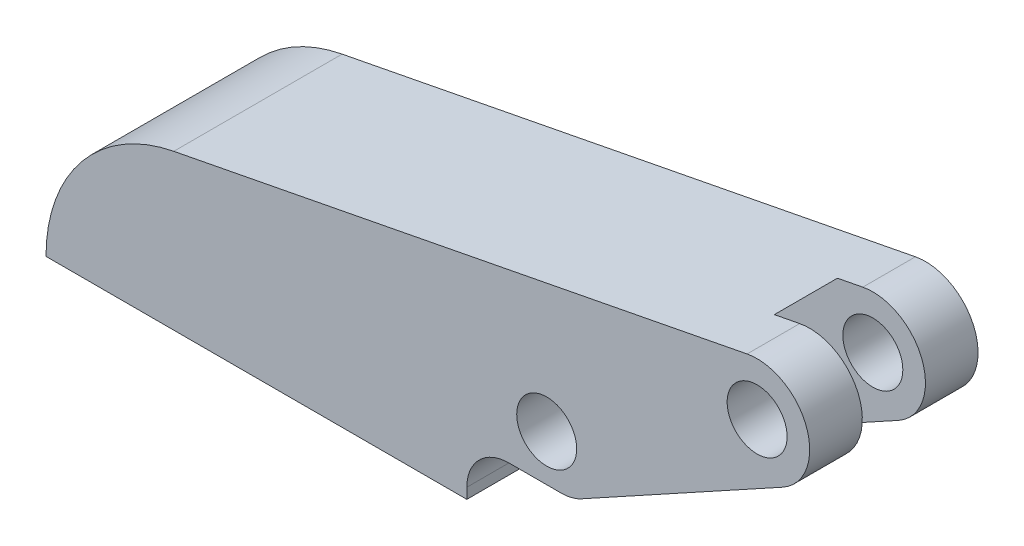
ISO-10303-21;
HEADER;
FILE_DESCRIPTION(('STEP AP214'),'2;1');
FILE_NAME('part.step','',(''),(''),'','','');
FILE_SCHEMA(('AUTOMOTIVE_DESIGN { 1 0 10303 214 1 1 1 1 }'));
ENDSEC;
DATA;
#1=APPLICATION_CONTEXT('core data for automotive mechanical design processes');
#2=APPLICATION_PROTOCOL_DEFINITION('international standard','automotive_design',2000,#1);
#3=PRODUCT_CONTEXT('',#1,'mechanical');
#4=PRODUCT('Part','Part','',(#3));
#5=PRODUCT_RELATED_PRODUCT_CATEGORY('part','',(#4));
#6=PRODUCT_DEFINITION_FORMATION('','',#4);
#7=PRODUCT_DEFINITION_CONTEXT('part definition',#1,'design');
#8=PRODUCT_DEFINITION('design','',#6,#7);
#9=PRODUCT_DEFINITION_SHAPE('','',#8);
#10=(LENGTH_UNIT() NAMED_UNIT(*) SI_UNIT(.MILLI.,.METRE.));
#11=(NAMED_UNIT(*) PLANE_ANGLE_UNIT() SI_UNIT($,.RADIAN.));
#12=(NAMED_UNIT(*) SI_UNIT($,.STERADIAN.) SOLID_ANGLE_UNIT());
#13=UNCERTAINTY_MEASURE_WITH_UNIT(LENGTH_MEASURE(1.E-05),#10,'distance_accuracy_value','');
#14=(GEOMETRIC_REPRESENTATION_CONTEXT(3) GLOBAL_UNCERTAINTY_ASSIGNED_CONTEXT((#13)) GLOBAL_UNIT_ASSIGNED_CONTEXT((#10,
#11,#12)) REPRESENTATION_CONTEXT('',''));
#15=CARTESIAN_POINT('',(0.,0.,0.));
#16=DIRECTION('',(0.,0.,1.));
#17=DIRECTION('',(1.,0.,0.));
#18=AXIS2_PLACEMENT_3D('',#15,#16,#17);
#19=CARTESIAN_POINT('',(45.8343180392922,14.7059179973023,16.));
#20=DIRECTION('',(-0.481918749772156,0.876215908676647,0.));
#21=DIRECTION('',(-0.876215908676647,-0.481918749772156,0.));
#22=AXIS2_PLACEMENT_3D('',#19,#20,#21);
#23=PLANE('',#22);
#24=DIRECTION('',(0.876215908676647,0.481918749772156,0.));
#25=VECTOR('',#24,1.);
#26=CARTESIAN_POINT('',(45.8343180392922,14.7059179973023,4.99999999999999));
#27=LINE('',#26,#25);
#28=CARTESIAN_POINT('',(42.5904062511392,12.9217665138182,5.));
#29=VERTEX_POINT('',#28);
#30=CARTESIAN_POINT('',(64.227719619958,24.8222888666685,4.99999999999999));
#31=VERTEX_POINT('',#30);
#32=EDGE_CURVE('E173',#29,#31,#27,.T.);
#33=ORIENTED_EDGE('',*,*,#32,.T.);
#34=DIRECTION('',(0.,0.,1.));
#35=VECTOR('',#34,1.);
#36=CARTESIAN_POINT('',(64.227719619958,24.8222888666685,16.));
#37=LINE('',#36,#35);
#38=CARTESIAN_POINT('',(64.2277196199582,24.8222888666686,11.));
#39=VERTEX_POINT('',#38);
#40=EDGE_CURVE('E14',#31,#39,#37,.T.);
#41=ORIENTED_EDGE('',*,*,#40,.T.);
#42=DIRECTION('',(0.876215908676647,0.481918749772156,0.));
#43=VECTOR('',#42,1.);
#44=CARTESIAN_POINT('',(86.6879313200957,37.1754053017442,11.));
#45=LINE('',#44,#43);
#46=CARTESIAN_POINT('',(42.5904062511392,12.9217665138182,11.));
#47=VERTEX_POINT('',#46);
#48=EDGE_CURVE('E391',#47,#39,#45,.T.);
#49=ORIENTED_EDGE('',*,*,#48,.F.);
#50=DIRECTION('',(0.,0.,1.));
#51=VECTOR('',#50,1.);
#52=CARTESIAN_POINT('',(42.5904062511392,12.9217665138182,11.));
#53=LINE('',#52,#51);
#54=EDGE_CURVE('E207',#29,#47,#53,.T.);
#55=ORIENTED_EDGE('',*,*,#54,.F.);
#56=EDGE_LOOP('',(#33,#41,#49,#55));
#57=FACE_BOUND('',#56,.T.);
#58=ADVANCED_FACE('F51',(#57),#23,.F.);
#59=CARTESIAN_POINT('',(72.5904062511392,62.8072690634833,11.));
#60=DIRECTION('',(0.,0.,-1.));
#61=DIRECTION('',(-1.,0.,0.));
#62=AXIS2_PLACEMENT_3D('',#59,#60,#61);
#63=PLANE('',#62);
#64=CARTESIAN_POINT('',(47.5904062511392,9.38107954338324,11.));
#65=DIRECTION('',(0.,0.,-1.));
#66=DIRECTION('',(-1.,0.,0.));
#67=AXIS2_PLACEMENT_3D('',#64,#65,#66);
#68=CIRCLE('',#67,2.85);
#69=CARTESIAN_POINT('',(44.7404062511392,9.38107954338324,11.));
#70=VERTEX_POINT('',#69);
#71=EDGE_CURVE('E385',#70,#70,#68,.T.);
#72=ORIENTED_EDGE('',*,*,#71,.F.);
#73=EDGE_LOOP('',(#72));
#74=FACE_BOUND('',#73,.T.);
#75=CARTESIAN_POINT('',(67.5904062511392,20.3810795433832,11.));
#76=DIRECTION('',(0.,0.,-1.));
#77=DIRECTION('',(-1.,0.,0.));
#78=AXIS2_PLACEMENT_3D('',#75,#76,#77);
#79=CIRCLE('',#78,2.85);
#80=CARTESIAN_POINT('',(64.7404062511392,20.3810795433832,11.));
#81=VERTEX_POINT('',#80);
#82=EDGE_CURVE('E206',#81,#81,#79,.T.);
#83=ORIENTED_EDGE('',*,*,#82,.F.);
#84=EDGE_LOOP('',(#83));
#85=FACE_BOUND('',#84,.T.);
#86=DIRECTION('',(-0.981723650130097,-0.190312045796475,0.));
#87=VECTOR('',#86,1.);
#88=CARTESIAN_POINT('',(12.1453193130529,14.7258547519514,11.));
#89=LINE('',#88,#87);
#90=CARTESIAN_POINT('',(66.6388460221569,25.2896977940337,11.));
#91=VERTEX_POINT('',#90);
#92=EDGE_CURVE('E58',#91,#39,#89,.T.);
#93=ORIENTED_EDGE('',*,*,#92,.F.);
#94=CARTESIAN_POINT('',(67.5904062511392,20.3810795433832,11.));
#95=DIRECTION('',(0.,0.,-1.));
#96=DIRECTION('',(-1.,0.,0.));
#97=AXIS2_PLACEMENT_3D('',#94,#95,#96);
#98=CIRCLE('',#97,5.);
#99=CARTESIAN_POINT('',(70.,16.,11.));
#100=VERTEX_POINT('',#99);
#101=EDGE_CURVE('E384',#100,#91,#98,.F.);
#102=ORIENTED_EDGE('',*,*,#101,.F.);
#103=DIRECTION('',(-0.876215908676647,-0.481918749772156,0.));
#104=VECTOR('',#103,1.);
#105=CARTESIAN_POINT('',(50.9002479368971,5.49513636529341,11.));
#106=LINE('',#105,#104);
#107=CARTESIAN_POINT('',(50.9002479368971,5.49513636529341,11.));
#108=VERTEX_POINT('',#107);
#109=EDGE_CURVE('E381',#100,#108,#106,.T.);
#110=ORIENTED_EDGE('',*,*,#109,.T.);
#111=CARTESIAN_POINT('',(48.9725729378085,9.,11.));
#112=DIRECTION('',(0.,0.,-1.));
#113=DIRECTION('',(-1.,0.,0.));
#114=AXIS2_PLACEMENT_3D('',#111,#112,#113);
#115=CIRCLE('',#114,4.);
#116=CARTESIAN_POINT('',(48.9725729378085,5.,11.));
#117=VERTEX_POINT('',#116);
#118=EDGE_CURVE('E376',#117,#108,#115,.F.);
#119=ORIENTED_EDGE('',*,*,#118,.F.);
#120=DIRECTION('',(-1.,0.,0.));
#121=VECTOR('',#120,1.);
#122=CARTESIAN_POINT('',(44.,5.,11.));
#123=LINE('',#122,#121);
#124=CARTESIAN_POINT('',(44.,5.,11.));
#125=VERTEX_POINT('',#124);
#126=EDGE_CURVE('E369',#117,#125,#123,.T.);
#127=ORIENTED_EDGE('',*,*,#126,.T.);
#128=CARTESIAN_POINT('',(44.,1.,11.));
#129=DIRECTION('',(0.,0.,-1.));
#130=DIRECTION('',(-1.,0.,0.));
#131=AXIS2_PLACEMENT_3D('',#128,#129,#130);
#132=CIRCLE('',#131,4.);
#133=CARTESIAN_POINT('',(42.5904062511392,4.74340025420374,11.));
#134=VERTEX_POINT('',#133);
#135=EDGE_CURVE('E315',#125,#134,#132,.F.);
#136=ORIENTED_EDGE('',*,*,#135,.T.);
#137=DIRECTION('',(0.,-1.,0.));
#138=VECTOR('',#137,1.);
#139=CARTESIAN_POINT('',(42.5904062511392,62.8072690634833,11.));
#140=LINE('',#139,#138);
#141=EDGE_CURVE('E190',#47,#134,#140,.T.);
#142=ORIENTED_EDGE('',*,*,#141,.F.);
#143=ORIENTED_EDGE('',*,*,#48,.T.);
#144=EDGE_LOOP('',(#93,#102,#110,#119,#127,#136,#142,#143));
#145=FACE_BOUND('',#144,.T.);
#146=ADVANCED_FACE('F457',(#74,#85,#145),#63,.T.);
#147=CARTESIAN_POINT('',(44.,1.,4.99999999999999));
#148=DIRECTION('',(0.,0.,1.));
#149=DIRECTION('',(1.,0.,0.));
#150=AXIS2_PLACEMENT_3D('',#147,#148,#149);
#151=PLANE('',#150);
#152=CARTESIAN_POINT('',(67.5904062511392,20.3810795433832,4.99999999999999));
#153=DIRECTION('',(0.,0.,-1.));
#154=DIRECTION('',(1.,0.,0.));
#155=AXIS2_PLACEMENT_3D('',#152,#153,#154);
#156=CIRCLE('',#155,2.85000000000001);
#157=CARTESIAN_POINT('',(70.4404062511392,20.3810795433832,4.99999999999999));
#158=VERTEX_POINT('',#157);
#159=EDGE_CURVE('E420',#158,#158,#156,.T.);
#160=ORIENTED_EDGE('',*,*,#159,.T.);
#161=EDGE_LOOP('',(#160));
#162=FACE_BOUND('',#161,.T.);
#163=CARTESIAN_POINT('',(47.5904062511392,9.38107954338324,4.99999999999999));
#164=DIRECTION('',(0.,0.,-1.));
#165=DIRECTION('',(1.,0.,0.));
#166=AXIS2_PLACEMENT_3D('',#163,#164,#165);
#167=CIRCLE('',#166,2.85);
#168=CARTESIAN_POINT('',(50.4404062511392,9.38107954338324,4.99999999999999));
#169=VERTEX_POINT('',#168);
#170=EDGE_CURVE('E408',#169,#169,#167,.T.);
#171=ORIENTED_EDGE('',*,*,#170,.T.);
#172=EDGE_LOOP('',(#171));
#173=FACE_BOUND('',#172,.T.);
#174=CARTESIAN_POINT('',(67.5904062511392,20.3810795433832,4.99999999999999));
#175=DIRECTION('',(0.,0.,-1.));
#176=DIRECTION('',(-1.,0.,0.));
#177=AXIS2_PLACEMENT_3D('',#174,#175,#176);
#178=CIRCLE('',#177,5.);
#179=CARTESIAN_POINT('',(66.6388460221569,25.2896977940337,4.99999999999999));
#180=VERTEX_POINT('',#179);
#181=CARTESIAN_POINT('',(70.,16.,4.99999999999999));
#182=VERTEX_POINT('',#181);
#183=EDGE_CURVE('E415',#180,#182,#178,.T.);
#184=ORIENTED_EDGE('',*,*,#183,.F.);
#185=DIRECTION('',(-0.981723650130097,-0.190312045796475,0.));
#186=VECTOR('',#185,1.);
#187=CARTESIAN_POINT('',(40.281811580834,20.1802546783549,4.99999999999999));
#188=LINE('',#187,#186);
#189=EDGE_CURVE('E192',#180,#31,#188,.T.);
#190=ORIENTED_EDGE('',*,*,#189,.T.);
#191=ORIENTED_EDGE('',*,*,#32,.F.);
#192=DIRECTION('',(0.,1.,0.));
#193=VECTOR('',#192,1.);
#194=CARTESIAN_POINT('',(42.5904062511392,4.74340025420374,5.));
#195=LINE('',#194,#193);
#196=CARTESIAN_POINT('',(42.5904062511392,4.74340025420374,5.));
#197=VERTEX_POINT('',#196);
#198=EDGE_CURVE('E166',#197,#29,#195,.T.);
#199=ORIENTED_EDGE('',*,*,#198,.F.);
#200=CARTESIAN_POINT('',(44.,1.,4.99999999999999));
#201=DIRECTION('',(0.,0.,1.));
#202=DIRECTION('',(1.,0.,0.));
#203=AXIS2_PLACEMENT_3D('',#200,#201,#202);
#204=CIRCLE('',#203,3.99999999999999);
#205=CARTESIAN_POINT('',(44.,5.,5.));
#206=VERTEX_POINT('',#205);
#207=EDGE_CURVE('E170',#206,#197,#204,.T.);
#208=ORIENTED_EDGE('',*,*,#207,.F.);
#209=DIRECTION('',(-1.,0.,0.));
#210=VECTOR('',#209,1.);
#211=CARTESIAN_POINT('',(48.9725729378085,5.,4.99999999999999));
#212=LINE('',#211,#210);
#213=CARTESIAN_POINT('',(48.9725729378085,5.,4.99999999999999));
#214=VERTEX_POINT('',#213);
#215=EDGE_CURVE('E396',#214,#206,#212,.T.);
#216=ORIENTED_EDGE('',*,*,#215,.F.);
#217=CARTESIAN_POINT('',(48.9725729378085,9.,4.99999999999999));
#218=DIRECTION('',(0.,0.,-1.));
#219=DIRECTION('',(-1.,0.,0.));
#220=AXIS2_PLACEMENT_3D('',#217,#218,#219);
#221=CIRCLE('',#220,4.);
#222=CARTESIAN_POINT('',(50.9002479368971,5.49513636529341,5.));
#223=VERTEX_POINT('',#222);
#224=EDGE_CURVE('E410',#223,#214,#221,.T.);
#225=ORIENTED_EDGE('',*,*,#224,.F.);
#226=DIRECTION('',(-0.876215908676647,-0.481918749772156,0.));
#227=VECTOR('',#226,1.);
#228=CARTESIAN_POINT('',(70.,16.,4.99999999999999));
#229=LINE('',#228,#227);
#230=EDGE_CURVE('E413',#182,#223,#229,.T.);
#231=ORIENTED_EDGE('',*,*,#230,.F.);
#232=EDGE_LOOP('',(#184,#190,#191,#199,#208,#216,#225,#231));
#233=FACE_BOUND('',#232,.T.);
#234=ADVANCED_FACE('F168',(#162,#173,#233),#151,.T.);
#235=CARTESIAN_POINT('',(67.5904062511392,20.3810795433832,16.));
#236=DIRECTION('',(0.,0.,-1.));
#237=DIRECTION('',(-1.,0.,0.));
#238=AXIS2_PLACEMENT_3D('',#235,#236,#237);
#239=CYLINDRICAL_SURFACE('',#238,5.);
#240=ORIENTED_EDGE('',*,*,#101,.T.);
#241=DIRECTION('',(0.,0.,-1.));
#242=VECTOR('',#241,1.);
#243=CARTESIAN_POINT('',(66.6388460221569,25.2896977940337,16.));
#244=LINE('',#243,#242);
#245=CARTESIAN_POINT('',(66.6388460221569,25.2896977940337,16.));
#246=VERTEX_POINT('',#245);
#247=EDGE_CURVE('E482',#246,#91,#244,.T.);
#248=ORIENTED_EDGE('',*,*,#247,.F.);
#249=CARTESIAN_POINT('',(67.5904062511392,20.3810795433832,16.));
#250=DIRECTION('',(0.,0.,-1.));
#251=DIRECTION('',(-1.,0.,0.));
#252=AXIS2_PLACEMENT_3D('',#249,#250,#251);
#253=CIRCLE('',#252,5.);
#254=CARTESIAN_POINT('',(70.,16.,16.));
#255=VERTEX_POINT('',#254);
#256=EDGE_CURVE('E286',#246,#255,#253,.T.);
#257=ORIENTED_EDGE('',*,*,#256,.T.);
#258=DIRECTION('',(0.,0.,-1.));
#259=VECTOR('',#258,1.);
#260=CARTESIAN_POINT('',(70.,16.,16.));
#261=LINE('',#260,#259);
#262=EDGE_CURVE('E349',#255,#100,#261,.T.);
#263=ORIENTED_EDGE('',*,*,#262,.T.);
#264=EDGE_LOOP('',(#240,#248,#257,#263));
#265=FACE_BOUND('',#264,.T.);
#266=ADVANCED_FACE('F481',(#265),#239,.T.);
#267=CARTESIAN_POINT('',(44.,1.,16.));
#268=DIRECTION('',(0.,0.,-1.));
#269=DIRECTION('',(-1.,0.,0.));
#270=AXIS2_PLACEMENT_3D('',#267,#268,#269);
#271=CYLINDRICAL_SURFACE('',#270,4.);
#272=CARTESIAN_POINT('',(44.,1.,0.));
#273=DIRECTION('',(0.,0.,-1.));
#274=DIRECTION('',(-1.,0.,0.));
#275=AXIS2_PLACEMENT_3D('',#272,#273,#274);
#276=CIRCLE('',#275,4.);
#277=CARTESIAN_POINT('',(40.,0.999999999999972,0.));
#278=VERTEX_POINT('',#277);
#279=CARTESIAN_POINT('',(44.,5.,0.));
#280=VERTEX_POINT('',#279);
#281=EDGE_CURVE('E259',#278,#280,#276,.T.);
#282=ORIENTED_EDGE('',*,*,#281,.T.);
#283=DIRECTION('',(0.,0.,-1.));
#284=VECTOR('',#283,1.);
#285=CARTESIAN_POINT('',(44.,5.,5.));
#286=LINE('',#285,#284);
#287=EDGE_CURVE('E184',#206,#280,#286,.T.);
#288=ORIENTED_EDGE('',*,*,#287,.F.);
#289=ORIENTED_EDGE('',*,*,#207,.T.);
#290=DIRECTION('',(0.,0.,-1.));
#291=VECTOR('',#290,1.);
#292=CARTESIAN_POINT('',(42.5904062511392,4.74340025420374,16.));
#293=LINE('',#292,#291);
#294=EDGE_CURVE('E182',#134,#197,#293,.T.);
#295=ORIENTED_EDGE('',*,*,#294,.F.);
#296=ORIENTED_EDGE('',*,*,#135,.F.);
#297=DIRECTION('',(0.,0.,-1.));
#298=VECTOR('',#297,1.);
#299=CARTESIAN_POINT('',(44.,5.,16.));
#300=LINE('',#299,#298);
#301=CARTESIAN_POINT('',(44.,5.,16.));
#302=VERTEX_POINT('',#301);
#303=EDGE_CURVE('E236',#302,#125,#300,.T.);
#304=ORIENTED_EDGE('',*,*,#303,.F.);
#305=CARTESIAN_POINT('',(44.,1.,16.));
#306=DIRECTION('',(0.,0.,-1.));
#307=DIRECTION('',(-1.,0.,0.));
#308=AXIS2_PLACEMENT_3D('',#305,#306,#307);
#309=CIRCLE('',#308,4.);
#310=CARTESIAN_POINT('',(40.,0.999999999999972,16.));
#311=VERTEX_POINT('',#310);
#312=EDGE_CURVE('E328',#311,#302,#309,.T.);
#313=ORIENTED_EDGE('',*,*,#312,.F.);
#314=DIRECTION('',(0.,0.,-1.));
#315=VECTOR('',#314,1.);
#316=CARTESIAN_POINT('',(40.,0.999999999999972,16.));
#317=LINE('',#316,#315);
#318=EDGE_CURVE('E231',#311,#278,#317,.T.);
#319=ORIENTED_EDGE('',*,*,#318,.T.);
#320=EDGE_LOOP('',(#282,#288,#289,#295,#296,#304,#313,#319));
#321=FACE_BOUND('',#320,.T.);
#322=ADVANCED_FACE('F180',(#321),#271,.F.);
#323=CARTESIAN_POINT('',(44.,5.,16.));
#324=DIRECTION('',(0.,1.,0.));
#325=DIRECTION('',(-1.,0.,0.));
#326=AXIS2_PLACEMENT_3D('',#323,#324,#325);
#327=PLANE('',#326);
#328=ORIENTED_EDGE('',*,*,#126,.F.);
#329=DIRECTION('',(0.,0.,-1.));
#330=VECTOR('',#329,1.);
#331=CARTESIAN_POINT('',(48.9725729378085,5.,16.));
#332=LINE('',#331,#330);
#333=CARTESIAN_POINT('',(48.9725729378085,5.,16.));
#334=VERTEX_POINT('',#333);
#335=EDGE_CURVE('E348',#334,#117,#332,.T.);
#336=ORIENTED_EDGE('',*,*,#335,.F.);
#337=DIRECTION('',(1.,0.,0.));
#338=VECTOR('',#337,1.);
#339=CARTESIAN_POINT('',(44.,5.,16.));
#340=LINE('',#339,#338);
#341=EDGE_CURVE('E332',#302,#334,#340,.T.);
#342=ORIENTED_EDGE('',*,*,#341,.F.);
#343=ORIENTED_EDGE('',*,*,#303,.T.);
#344=EDGE_LOOP('',(#328,#336,#342,#343));
#345=FACE_BOUND('',#344,.T.);
#346=ADVANCED_FACE('F368',(#345),#327,.F.);
#347=CARTESIAN_POINT('',(48.9725729378085,9.,16.));
#348=DIRECTION('',(0.,0.,-1.));
#349=DIRECTION('',(-1.,0.,0.));
#350=AXIS2_PLACEMENT_3D('',#347,#348,#349);
#351=CYLINDRICAL_SURFACE('',#350,4.);
#352=ORIENTED_EDGE('',*,*,#335,.T.);
#353=ORIENTED_EDGE('',*,*,#118,.T.);
#354=DIRECTION('',(0.,0.,-1.));
#355=VECTOR('',#354,1.);
#356=CARTESIAN_POINT('',(50.9002479368971,5.49513636529341,16.));
#357=LINE('',#356,#355);
#358=CARTESIAN_POINT('',(50.9002479368971,5.49513636529341,16.));
#359=VERTEX_POINT('',#358);
#360=EDGE_CURVE('E344',#359,#108,#357,.T.);
#361=ORIENTED_EDGE('',*,*,#360,.F.);
#362=CARTESIAN_POINT('',(48.9725729378085,9.,16.));
#363=DIRECTION('',(0.,0.,-1.));
#364=DIRECTION('',(-1.,0.,0.));
#365=AXIS2_PLACEMENT_3D('',#362,#363,#364);
#366=CIRCLE('',#365,4.);
#367=EDGE_CURVE('E864',#359,#334,#366,.T.);
#368=ORIENTED_EDGE('',*,*,#367,.T.);
#369=EDGE_LOOP('',(#352,#353,#361,#368));
#370=FACE_BOUND('',#369,.T.);
#371=ADVANCED_FACE('F568',(#370),#351,.T.);
#372=CARTESIAN_POINT('',(50.9002479368971,5.49513636529341,16.));
#373=DIRECTION('',(-0.481918749772156,0.876215908676647,0.));
#374=DIRECTION('',(-0.876215908676647,-0.481918749772156,0.));
#375=AXIS2_PLACEMENT_3D('',#372,#373,#374);
#376=PLANE('',#375);
#377=ORIENTED_EDGE('',*,*,#109,.F.);
#378=ORIENTED_EDGE('',*,*,#262,.F.);
#379=DIRECTION('',(0.876215908676647,0.481918749772156,0.));
#380=VECTOR('',#379,1.);
#381=CARTESIAN_POINT('',(50.9002479368971,5.49513636529341,16.));
#382=LINE('',#381,#380);
#383=EDGE_CURVE('E293',#359,#255,#382,.T.);
#384=ORIENTED_EDGE('',*,*,#383,.F.);
#385=ORIENTED_EDGE('',*,*,#360,.T.);
#386=EDGE_LOOP('',(#377,#378,#384,#385));
#387=FACE_BOUND('',#386,.T.);
#388=ADVANCED_FACE('F580',(#387),#376,.F.);
#389=CARTESIAN_POINT('',(66.6388460221569,25.2896977940337,0.));
#390=VERTEX_POINT('',#389);
#391=EDGE_CURVE('E489',#180,#390,#244,.T.);
#392=ORIENTED_EDGE('',*,*,#391,.F.);
#393=ORIENTED_EDGE('',*,*,#183,.T.);
#394=DIRECTION('',(0.,0.,-1.));
#395=VECTOR('',#394,1.);
#396=CARTESIAN_POINT('',(70.,16.,4.99999999999999));
#397=LINE('',#396,#395);
#398=CARTESIAN_POINT('',(70.,16.,0.));
#399=VERTEX_POINT('',#398);
#400=EDGE_CURVE('E392',#182,#399,#397,.T.);
#401=ORIENTED_EDGE('',*,*,#400,.T.);
#402=CARTESIAN_POINT('',(67.5904062511392,20.3810795433832,0.));
#403=DIRECTION('',(0.,0.,-1.));
#404=DIRECTION('',(-1.,0.,0.));
#405=AXIS2_PLACEMENT_3D('',#402,#403,#404);
#406=CIRCLE('',#405,5.);
#407=EDGE_CURVE('E266',#390,#399,#406,.T.);
#408=ORIENTED_EDGE('',*,*,#407,.F.);
#409=EDGE_LOOP('',(#392,#393,#401,#408));
#410=FACE_BOUND('',#409,.T.);
#411=ADVANCED_FACE('F592',(#410),#239,.T.);
#412=CARTESIAN_POINT('',(47.5904062511392,9.38107954338324,16.));
#413=DIRECTION('',(0.,0.,-1.));
#414=DIRECTION('',(-1.,0.,0.));
#415=AXIS2_PLACEMENT_3D('',#412,#413,#414);
#416=CYLINDRICAL_SURFACE('',#415,2.85);
#417=CARTESIAN_POINT('',(47.5904062511392,9.38107954338324,16.));
#418=DIRECTION('',(0.,0.,1.));
#419=DIRECTION('',(1.,0.,0.));
#420=AXIS2_PLACEMENT_3D('',#417,#418,#419);
#421=CIRCLE('',#420,2.85);
#422=CARTESIAN_POINT('',(50.4404062511392,9.38107954338324,16.));
#423=VERTEX_POINT('',#422);
#424=EDGE_CURVE('E300',#423,#423,#421,.T.);
#425=ORIENTED_EDGE('',*,*,#424,.T.);
#426=EDGE_LOOP('',(#425));
#427=FACE_BOUND('',#426,.T.);
#428=ORIENTED_EDGE('',*,*,#71,.T.);
#429=EDGE_LOOP('',(#428));
#430=FACE_BOUND('',#429,.T.);
#431=ADVANCED_FACE('F605',(#427,#430),#416,.F.);
#432=CARTESIAN_POINT('',(67.5904062511392,20.3810795433832,16.));
#433=DIRECTION('',(0.,0.,-1.));
#434=DIRECTION('',(-1.,0.,0.));
#435=AXIS2_PLACEMENT_3D('',#432,#433,#434);
#436=CYLINDRICAL_SURFACE('',#435,2.85);
#437=CARTESIAN_POINT('',(67.5904062511392,20.3810795433832,16.));
#438=DIRECTION('',(0.,0.,1.));
#439=DIRECTION('',(1.,0.,0.));
#440=AXIS2_PLACEMENT_3D('',#437,#438,#439);
#441=CIRCLE('',#440,2.85);
#442=CARTESIAN_POINT('',(70.4404062511392,20.3810795433832,16.));
#443=VERTEX_POINT('',#442);
#444=EDGE_CURVE('E307',#443,#443,#441,.T.);
#445=ORIENTED_EDGE('',*,*,#444,.T.);
#446=EDGE_LOOP('',(#445));
#447=FACE_BOUND('',#446,.T.);
#448=ORIENTED_EDGE('',*,*,#82,.T.);
#449=EDGE_LOOP('',(#448));
#450=FACE_BOUND('',#449,.T.);
#451=ADVANCED_FACE('F618',(#447,#450),#436,.F.);
#452=CARTESIAN_POINT('',(15.,0.,16.));
#453=DIRECTION('',(0.,0.,1.));
#454=DIRECTION('',(1.,0.,0.));
#455=AXIS2_PLACEMENT_3D('',#452,#453,#454);
#456=PLANE('',#455);
#457=ORIENTED_EDGE('',*,*,#424,.F.);
#458=EDGE_LOOP('',(#457));
#459=FACE_BOUND('',#458,.T.);
#460=CARTESIAN_POINT('',(15.,0.,16.));
#461=DIRECTION('',(0.,0.,1.));
#462=DIRECTION('',(1.,0.,0.));
#463=AXIS2_PLACEMENT_3D('',#460,#461,#462);
#464=CIRCLE('',#463,15.);
#465=CARTESIAN_POINT('',(12.1453193130529,14.7258547519514,16.));
#466=VERTEX_POINT('',#465);
#467=CARTESIAN_POINT('',(0.,0.,16.));
#468=VERTEX_POINT('',#467);
#469=EDGE_CURVE('E319',#466,#468,#464,.T.);
#470=ORIENTED_EDGE('',*,*,#469,.T.);
#471=DIRECTION('',(1.,0.,0.));
#472=VECTOR('',#471,1.);
#473=CARTESIAN_POINT('',(0.,0.,16.));
#474=LINE('',#473,#472);
#475=CARTESIAN_POINT('',(40.,0.,16.));
#476=VERTEX_POINT('',#475);
#477=EDGE_CURVE('E323',#468,#476,#474,.T.);
#478=ORIENTED_EDGE('',*,*,#477,.T.);
#479=DIRECTION('',(0.,1.,0.));
#480=VECTOR('',#479,1.);
#481=CARTESIAN_POINT('',(40.,0.,16.));
#482=LINE('',#481,#480);
#483=EDGE_CURVE('E250',#476,#311,#482,.T.);
#484=ORIENTED_EDGE('',*,*,#483,.T.);
#485=ORIENTED_EDGE('',*,*,#312,.T.);
#486=ORIENTED_EDGE('',*,*,#341,.T.);
#487=ORIENTED_EDGE('',*,*,#367,.F.);
#488=ORIENTED_EDGE('',*,*,#383,.T.);
#489=ORIENTED_EDGE('',*,*,#256,.F.);
#490=DIRECTION('',(0.981723650130097,0.190312045796475,0.));
#491=VECTOR('',#490,1.);
#492=CARTESIAN_POINT('',(12.1453193130529,14.7258547519514,16.));
#493=LINE('',#492,#491);
#494=EDGE_CURVE('E292',#466,#246,#493,.T.);
#495=ORIENTED_EDGE('',*,*,#494,.F.);
#496=EDGE_LOOP('',(#470,#478,#484,#485,#486,#487,#488,#489,#495));
#497=FACE_BOUND('',#496,.T.);
#498=ORIENTED_EDGE('',*,*,#444,.F.);
#499=EDGE_LOOP('',(#498));
#500=FACE_BOUND('',#499,.T.);
#501=ADVANCED_FACE('F440',(#459,#497,#500),#456,.T.);
#502=CARTESIAN_POINT('',(15.,0.,0.));
#503=DIRECTION('',(0.,0.,1.));
#504=DIRECTION('',(1.,0.,0.));
#505=AXIS2_PLACEMENT_3D('',#502,#503,#504);
#506=PLANE('',#505);
#507=DIRECTION('',(-1.,0.,0.));
#508=VECTOR('',#507,1.);
#509=CARTESIAN_POINT('',(48.9725729378085,5.,0.));
#510=LINE('',#509,#508);
#511=CARTESIAN_POINT('',(48.9725729378085,5.,0.));
#512=VERTEX_POINT('',#511);
#513=EDGE_CURVE('E185',#512,#280,#510,.T.);
#514=ORIENTED_EDGE('',*,*,#513,.T.);
#515=ORIENTED_EDGE('',*,*,#281,.F.);
#516=DIRECTION('',(0.,1.,0.));
#517=VECTOR('',#516,1.);
#518=CARTESIAN_POINT('',(40.,0.,0.));
#519=LINE('',#518,#517);
#520=CARTESIAN_POINT('',(40.,0.,0.));
#521=VERTEX_POINT('',#520);
#522=EDGE_CURVE('E249',#521,#278,#519,.T.);
#523=ORIENTED_EDGE('',*,*,#522,.F.);
#524=DIRECTION('',(1.,0.,0.));
#525=VECTOR('',#524,1.);
#526=CARTESIAN_POINT('',(0.,0.,0.));
#527=LINE('',#526,#525);
#528=CARTESIAN_POINT('',(0.,0.,0.));
#529=VERTEX_POINT('',#528);
#530=EDGE_CURVE('E258',#529,#521,#527,.T.);
#531=ORIENTED_EDGE('',*,*,#530,.F.);
#532=CARTESIAN_POINT('',(15.,0.,0.));
#533=DIRECTION('',(0.,0.,1.));
#534=DIRECTION('',(1.,0.,0.));
#535=AXIS2_PLACEMENT_3D('',#532,#533,#534);
#536=CIRCLE('',#535,15.);
#537=CARTESIAN_POINT('',(12.1453193130529,14.7258547519514,0.));
#538=VERTEX_POINT('',#537);
#539=EDGE_CURVE('E268',#538,#529,#536,.T.);
#540=ORIENTED_EDGE('',*,*,#539,.F.);
#541=DIRECTION('',(0.981723650130097,0.190312045796475,0.));
#542=VECTOR('',#541,1.);
#543=CARTESIAN_POINT('',(12.1453193130529,14.7258547519514,0.));
#544=LINE('',#543,#542);
#545=EDGE_CURVE('E275',#538,#390,#544,.T.);
#546=ORIENTED_EDGE('',*,*,#545,.T.);
#547=ORIENTED_EDGE('',*,*,#407,.T.);
#548=DIRECTION('',(-0.876215908676647,-0.481918749772156,0.));
#549=VECTOR('',#548,1.);
#550=CARTESIAN_POINT('',(70.,16.,0.));
#551=LINE('',#550,#549);
#552=CARTESIAN_POINT('',(50.9002479368971,5.49513636529341,0.));
#553=VERTEX_POINT('',#552);
#554=EDGE_CURVE('E405',#399,#553,#551,.T.);
#555=ORIENTED_EDGE('',*,*,#554,.T.);
#556=CARTESIAN_POINT('',(48.9725729378085,9.,0.));
#557=DIRECTION('',(0.,0.,-1.));
#558=DIRECTION('',(-1.,0.,0.));
#559=AXIS2_PLACEMENT_3D('',#556,#557,#558);
#560=CIRCLE('',#559,4.);
#561=EDGE_CURVE('E402',#553,#512,#560,.T.);
#562=ORIENTED_EDGE('',*,*,#561,.T.);
#563=EDGE_LOOP('',(#514,#515,#523,#531,#540,#546,#547,#555,#562));
#564=FACE_BOUND('',#563,.T.);
#565=CARTESIAN_POINT('',(67.5904062511392,20.3810795433832,0.));
#566=DIRECTION('',(0.,0.,-1.));
#567=DIRECTION('',(1.,0.,0.));
#568=AXIS2_PLACEMENT_3D('',#565,#566,#567);
#569=CIRCLE('',#568,2.85000000000001);
#570=CARTESIAN_POINT('',(70.4404062511392,20.3810795433832,0.));
#571=VERTEX_POINT('',#570);
#572=EDGE_CURVE('E423',#571,#571,#569,.T.);
#573=ORIENTED_EDGE('',*,*,#572,.F.);
#574=EDGE_LOOP('',(#573));
#575=FACE_BOUND('',#574,.T.);
#576=CARTESIAN_POINT('',(47.5904062511392,9.38107954338324,0.));
#577=DIRECTION('',(0.,0.,-1.));
#578=DIRECTION('',(1.,0.,0.));
#579=AXIS2_PLACEMENT_3D('',#576,#577,#578);
#580=CIRCLE('',#579,2.85);
#581=CARTESIAN_POINT('',(50.4404062511392,9.38107954338324,0.));
#582=VERTEX_POINT('',#581);
#583=EDGE_CURVE('E417',#582,#582,#580,.T.);
#584=ORIENTED_EDGE('',*,*,#583,.F.);
#585=EDGE_LOOP('',(#584));
#586=FACE_BOUND('',#585,.T.);
#587=ADVANCED_FACE('F255',(#564,#575,#586),#506,.F.);
#588=CARTESIAN_POINT('',(15.,0.,16.));
#589=DIRECTION('',(0.,0.,-1.));
#590=DIRECTION('',(-1.,0.,0.));
#591=AXIS2_PLACEMENT_3D('',#588,#589,#590);
#592=CYLINDRICAL_SURFACE('',#591,15.);
#593=ORIENTED_EDGE('',*,*,#539,.T.);
#594=DIRECTION('',(0.,0.,-1.));
#595=VECTOR('',#594,1.);
#596=CARTESIAN_POINT('',(0.,0.,16.));
#597=LINE('',#596,#595);
#598=EDGE_CURVE('E193',#468,#529,#597,.T.);
#599=ORIENTED_EDGE('',*,*,#598,.F.);
#600=ORIENTED_EDGE('',*,*,#469,.F.);
#601=DIRECTION('',(0.,0.,-1.));
#602=VECTOR('',#601,1.);
#603=CARTESIAN_POINT('',(12.1453193130529,14.7258547519514,16.));
#604=LINE('',#603,#602);
#605=EDGE_CURVE('E297',#466,#538,#604,.T.);
#606=ORIENTED_EDGE('',*,*,#605,.T.);
#607=EDGE_LOOP('',(#593,#599,#600,#606));
#608=FACE_BOUND('',#607,.T.);
#609=ADVANCED_FACE('F439',(#608),#592,.T.);
#610=CARTESIAN_POINT('',(0.,0.,16.));
#611=DIRECTION('',(0.,1.,0.));
#612=DIRECTION('',(0.,0.,1.));
#613=AXIS2_PLACEMENT_3D('',#610,#611,#612);
#614=PLANE('',#613);
#615=ORIENTED_EDGE('',*,*,#530,.T.);
#616=DIRECTION('',(0.,0.,-1.));
#617=VECTOR('',#616,1.);
#618=CARTESIAN_POINT('',(40.,0.,16.));
#619=LINE('',#618,#617);
#620=EDGE_CURVE('E201',#476,#521,#619,.T.);
#621=ORIENTED_EDGE('',*,*,#620,.F.);
#622=ORIENTED_EDGE('',*,*,#477,.F.);
#623=ORIENTED_EDGE('',*,*,#598,.T.);
#624=EDGE_LOOP('',(#615,#621,#622,#623));
#625=FACE_BOUND('',#624,.T.);
#626=ADVANCED_FACE('F663',(#625),#614,.F.);
#627=CARTESIAN_POINT('',(40.,0.,16.));
#628=DIRECTION('',(-1.,0.,0.));
#629=DIRECTION('',(0.,0.,1.));
#630=AXIS2_PLACEMENT_3D('',#627,#628,#629);
#631=PLANE('',#630);
#632=ORIENTED_EDGE('',*,*,#522,.T.);
#633=ORIENTED_EDGE('',*,*,#318,.F.);
#634=ORIENTED_EDGE('',*,*,#483,.F.);
#635=ORIENTED_EDGE('',*,*,#620,.T.);
#636=EDGE_LOOP('',(#632,#633,#634,#635));
#637=FACE_BOUND('',#636,.T.);
#638=ADVANCED_FACE('F247',(#637),#631,.F.);
#639=CARTESIAN_POINT('',(12.1453193130529,14.7258547519514,16.));
#640=DIRECTION('',(-0.190312045796475,0.981723650130097,0.));
#641=DIRECTION('',(-0.981723650130097,-0.190312045796475,0.));
#642=AXIS2_PLACEMENT_3D('',#639,#640,#641);
#643=PLANE('',#642);
#644=ORIENTED_EDGE('',*,*,#40,.F.);
#645=ORIENTED_EDGE('',*,*,#189,.F.);
#646=ORIENTED_EDGE('',*,*,#391,.T.);
#647=ORIENTED_EDGE('',*,*,#545,.F.);
#648=ORIENTED_EDGE('',*,*,#605,.F.);
#649=ORIENTED_EDGE('',*,*,#494,.T.);
#650=ORIENTED_EDGE('',*,*,#247,.T.);
#651=ORIENTED_EDGE('',*,*,#92,.T.);
#652=EDGE_LOOP('',(#644,#645,#646,#647,#648,#649,#650,#651));
#653=FACE_BOUND('',#652,.T.);
#654=ADVANCED_FACE('F486',(#653),#643,.T.);
#655=CARTESIAN_POINT('',(42.5904062511392,62.8072690634833,11.));
#656=DIRECTION('',(1.,0.,0.));
#657=DIRECTION('',(0.,0.,-1.));
#658=AXIS2_PLACEMENT_3D('',#655,#656,#657);
#659=PLANE('',#658);
#660=ORIENTED_EDGE('',*,*,#198,.T.);
#661=ORIENTED_EDGE('',*,*,#54,.T.);
#662=ORIENTED_EDGE('',*,*,#141,.T.);
#663=ORIENTED_EDGE('',*,*,#294,.T.);
#664=EDGE_LOOP('',(#660,#661,#662,#663));
#665=FACE_BOUND('',#664,.T.);
#666=ADVANCED_FACE('F188',(#665),#659,.T.);
#667=CARTESIAN_POINT('',(48.9725729378085,5.,4.99999999999999));
#668=DIRECTION('',(0.,-1.,0.));
#669=DIRECTION('',(0.,0.,-1.));
#670=AXIS2_PLACEMENT_3D('',#667,#668,#669);
#671=PLANE('',#670);
#672=ORIENTED_EDGE('',*,*,#513,.F.);
#673=DIRECTION('',(0.,0.,-1.));
#674=VECTOR('',#673,1.);
#675=CARTESIAN_POINT('',(48.9725729378085,5.,4.99999999999999));
#676=LINE('',#675,#674);
#677=EDGE_CURVE('E398',#214,#512,#676,.T.);
#678=ORIENTED_EDGE('',*,*,#677,.F.);
#679=ORIENTED_EDGE('',*,*,#215,.T.);
#680=ORIENTED_EDGE('',*,*,#287,.T.);
#681=EDGE_LOOP('',(#672,#678,#679,#680));
#682=FACE_BOUND('',#681,.T.);
#683=ADVANCED_FACE('F705',(#682),#671,.T.);
#684=CARTESIAN_POINT('',(48.9725729378085,9.,4.99999999999999));
#685=DIRECTION('',(0.,0.,-1.));
#686=DIRECTION('',(-1.,0.,0.));
#687=AXIS2_PLACEMENT_3D('',#684,#685,#686);
#688=CYLINDRICAL_SURFACE('',#687,4.);
#689=ORIENTED_EDGE('',*,*,#561,.F.);
#690=DIRECTION('',(0.,0.,-1.));
#691=VECTOR('',#690,1.);
#692=CARTESIAN_POINT('',(50.9002479368971,5.49513636529341,5.));
#693=LINE('',#692,#691);
#694=EDGE_CURVE('E395',#223,#553,#693,.T.);
#695=ORIENTED_EDGE('',*,*,#694,.F.);
#696=ORIENTED_EDGE('',*,*,#224,.T.);
#697=ORIENTED_EDGE('',*,*,#677,.T.);
#698=EDGE_LOOP('',(#689,#695,#696,#697));
#699=FACE_BOUND('',#698,.T.);
#700=ADVANCED_FACE('F451',(#699),#688,.T.);
#701=CARTESIAN_POINT('',(70.,16.,4.99999999999999));
#702=DIRECTION('',(0.481918749772156,-0.876215908676647,0.));
#703=DIRECTION('',(0.876215908676647,0.481918749772156,0.));
#704=AXIS2_PLACEMENT_3D('',#701,#702,#703);
#705=PLANE('',#704);
#706=ORIENTED_EDGE('',*,*,#554,.F.);
#707=ORIENTED_EDGE('',*,*,#400,.F.);
#708=ORIENTED_EDGE('',*,*,#230,.T.);
#709=ORIENTED_EDGE('',*,*,#694,.T.);
#710=EDGE_LOOP('',(#706,#707,#708,#709));
#711=FACE_BOUND('',#710,.T.);
#712=ADVANCED_FACE('F445',(#711),#705,.T.);
#713=CARTESIAN_POINT('',(47.5904062511392,9.38107954338324,4.99999999999999));
#714=DIRECTION('',(0.,0.,-1.));
#715=DIRECTION('',(-1.,0.,0.));
#716=AXIS2_PLACEMENT_3D('',#713,#714,#715);
#717=CYLINDRICAL_SURFACE('',#716,2.85);
#718=ORIENTED_EDGE('',*,*,#170,.F.);
#719=EDGE_LOOP('',(#718));
#720=FACE_BOUND('',#719,.T.);
#721=ORIENTED_EDGE('',*,*,#583,.T.);
#722=EDGE_LOOP('',(#721));
#723=FACE_BOUND('',#722,.T.);
#724=ADVANCED_FACE('F434',(#720,#723),#717,.F.);
#725=CARTESIAN_POINT('',(67.5904062511392,20.3810795433832,4.99999999999999));
#726=DIRECTION('',(0.,0.,-1.));
#727=DIRECTION('',(-1.,0.,0.));
#728=AXIS2_PLACEMENT_3D('',#725,#726,#727);
#729=CYLINDRICAL_SURFACE('',#728,2.85000000000001);
#730=ORIENTED_EDGE('',*,*,#159,.F.);
#731=EDGE_LOOP('',(#730));
#732=FACE_BOUND('',#731,.T.);
#733=ORIENTED_EDGE('',*,*,#572,.T.);
#734=EDGE_LOOP('',(#733));
#735=FACE_BOUND('',#734,.T.);
#736=ADVANCED_FACE('F431',(#732,#735),#729,.F.);
#737=CLOSED_SHELL('',(#58,#146,#234,#266,#322,#346,#371,#388,#411,#431,#451,#501,#587,#609,#626,
#638,#654,#666,#683,#700,#712,#724,#736));
#738=MANIFOLD_SOLID_BREP('B2',#737);
#739=ADVANCED_BREP_SHAPE_REPRESENTATION('',(#18,#738),#14);
#740=SHAPE_DEFINITION_REPRESENTATION(#9,#739);
ENDSEC;
END-ISO-10303-21;
